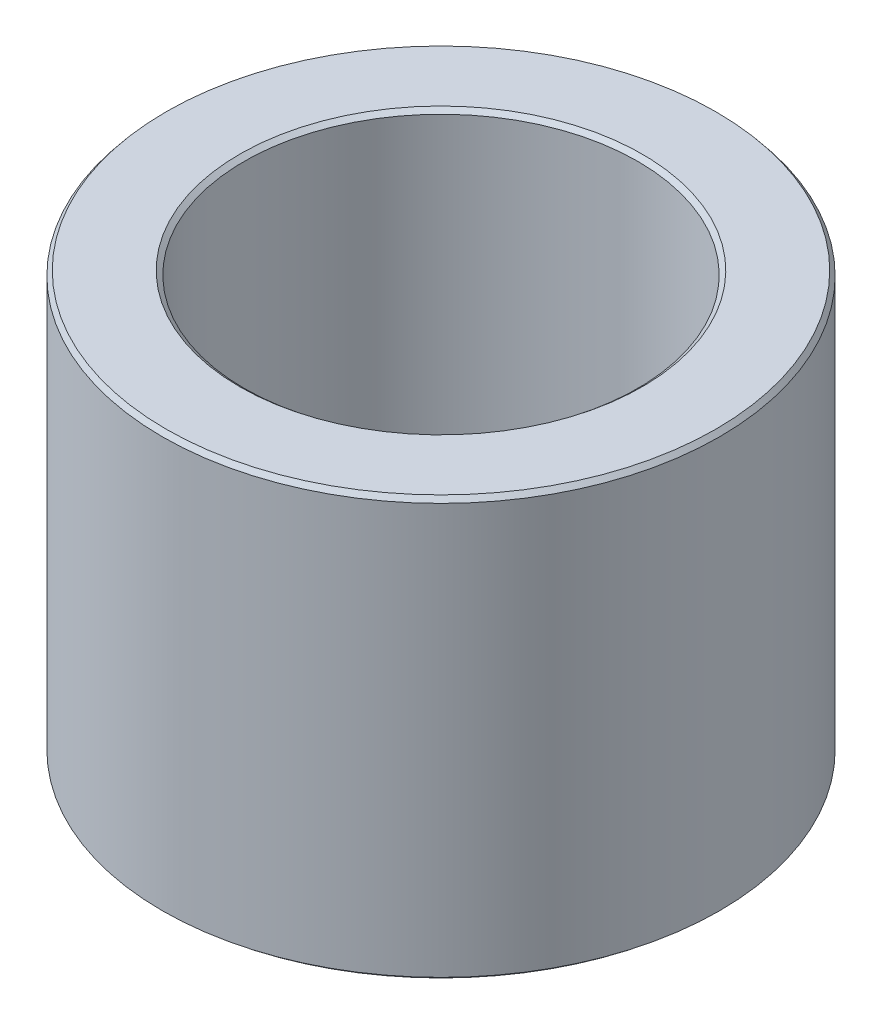
ISO-10303-21;
HEADER;
FILE_DESCRIPTION(('STEP AP214'),'2;1');
FILE_NAME('part.step','',(''),(''),'','','');
FILE_SCHEMA(('AUTOMOTIVE_DESIGN { 1 0 10303 214 1 1 1 1 }'));
ENDSEC;
DATA;
#1=APPLICATION_CONTEXT('core data for automotive mechanical design processes');
#2=APPLICATION_PROTOCOL_DEFINITION('international standard','automotive_design',2000,#1);
#3=PRODUCT_CONTEXT('',#1,'mechanical');
#4=PRODUCT('Part','Part','',(#3));
#5=PRODUCT_RELATED_PRODUCT_CATEGORY('part','',(#4));
#6=PRODUCT_DEFINITION_FORMATION('','',#4);
#7=PRODUCT_DEFINITION_CONTEXT('part definition',#1,'design');
#8=PRODUCT_DEFINITION('design','',#6,#7);
#9=PRODUCT_DEFINITION_SHAPE('','',#8);
#10=(LENGTH_UNIT() NAMED_UNIT(*) SI_UNIT(.MILLI.,.METRE.));
#11=(NAMED_UNIT(*) PLANE_ANGLE_UNIT() SI_UNIT($,.RADIAN.));
#12=(NAMED_UNIT(*) SI_UNIT($,.STERADIAN.) SOLID_ANGLE_UNIT());
#13=UNCERTAINTY_MEASURE_WITH_UNIT(LENGTH_MEASURE(1.E-05),#10,'distance_accuracy_value','');
#14=(GEOMETRIC_REPRESENTATION_CONTEXT(3) GLOBAL_UNCERTAINTY_ASSIGNED_CONTEXT((#13)) GLOBAL_UNIT_ASSIGNED_CONTEXT((#10,
#11,#12)) REPRESENTATION_CONTEXT('',''));
#15=CARTESIAN_POINT('',(0.,0.,0.));
#16=DIRECTION('',(0.,0.,1.));
#17=DIRECTION('',(1.,0.,0.));
#18=AXIS2_PLACEMENT_3D('',#15,#16,#17);
#19=CARTESIAN_POINT('',(0.,82.6806241104287,0.));
#20=DIRECTION('',(0.,-1.,0.));
#21=DIRECTION('',(0.,0.,-1.));
#22=AXIS2_PLACEMENT_3D('',#19,#20,#21);
#23=CYLINDRICAL_SURFACE('',#22,55.);
#24=CARTESIAN_POINT('',(0.,0.753056338464786,0.));
#25=DIRECTION('',(0.,1.,0.));
#26=DIRECTION('',(0.,0.,1.));
#27=AXIS2_PLACEMENT_3D('',#24,#25,#26);
#28=CIRCLE('',#27,55.);
#29=CARTESIAN_POINT('',(0.,0.753056338464786,55.));
#30=VERTEX_POINT('',#29);
#31=EDGE_CURVE('E10',#30,#30,#28,.T.);
#32=ORIENTED_EDGE('',*,*,#31,.T.);
#33=EDGE_LOOP('',(#32));
#34=FACE_BOUND('',#33,.T.);
#35=CARTESIAN_POINT('',(0.,81.7594876947384,0.));
#36=DIRECTION('',(0.,1.,0.));
#37=DIRECTION('',(0.,0.,1.));
#38=AXIS2_PLACEMENT_3D('',#35,#36,#37);
#39=CIRCLE('',#38,55.);
#40=CARTESIAN_POINT('',(0.,81.7594876947384,55.));
#41=VERTEX_POINT('',#40);
#42=EDGE_CURVE('E50',#41,#41,#39,.F.);
#43=ORIENTED_EDGE('',*,*,#42,.T.);
#44=EDGE_LOOP('',(#43));
#45=FACE_BOUND('',#44,.T.);
#46=ADVANCED_FACE('F39',(#34,#45),#23,.T.);
#47=CARTESIAN_POINT('',(0.,82.6806241104287,0.));
#48=DIRECTION('',(0.,1.,0.));
#49=DIRECTION('',(0.,0.,1.));
#50=AXIS2_PLACEMENT_3D('',#47,#48,#49);
#51=PLANE('',#50);
#52=CARTESIAN_POINT('',(0.,82.6806241104287,0.));
#53=DIRECTION('',(0.,1.,0.));
#54=DIRECTION('',(0.,0.,1.));
#55=AXIS2_PLACEMENT_3D('',#52,#53,#54);
#56=CIRCLE('',#55,39.7428480351677);
#57=CARTESIAN_POINT('',(0.,82.6806241104287,39.7428480351677));
#58=VERTEX_POINT('',#57);
#59=EDGE_CURVE('E58',#58,#58,#56,.F.);
#60=ORIENTED_EDGE('',*,*,#59,.T.);
#61=EDGE_LOOP('',(#60));
#62=FACE_BOUND('',#61,.T.);
#63=CARTESIAN_POINT('',(0.,82.6806241104287,0.));
#64=DIRECTION('',(0.,1.,0.));
#65=DIRECTION('',(0.,0.,1.));
#66=AXIS2_PLACEMENT_3D('',#63,#64,#65);
#67=CIRCLE('',#66,54.2469436615352);
#68=CARTESIAN_POINT('',(0.,82.6806241104287,54.2469436615352));
#69=VERTEX_POINT('',#68);
#70=EDGE_CURVE('E61',#69,#69,#67,.T.);
#71=ORIENTED_EDGE('',*,*,#70,.T.);
#72=EDGE_LOOP('',(#71));
#73=FACE_BOUND('',#72,.T.);
#74=ADVANCED_FACE('F88',(#62,#73),#51,.T.);
#75=CARTESIAN_POINT('',(0.,0.,0.));
#76=DIRECTION('',(0.,1.,0.));
#77=DIRECTION('',(0.,0.,1.));
#78=AXIS2_PLACEMENT_3D('',#75,#76,#77);
#79=PLANE('',#78);
#80=CARTESIAN_POINT('',(0.,0.,0.));
#81=DIRECTION('',(0.,1.,0.));
#82=DIRECTION('',(0.,0.,1.));
#83=AXIS2_PLACEMENT_3D('',#80,#81,#82);
#84=CIRCLE('',#83,39.5747679579423);
#85=CARTESIAN_POINT('',(0.,0.,39.5747679579423));
#86=VERTEX_POINT('',#85);
#87=EDGE_CURVE('E51',#86,#86,#84,.T.);
#88=ORIENTED_EDGE('',*,*,#87,.T.);
#89=EDGE_LOOP('',(#88));
#90=FACE_BOUND('',#89,.T.);
#91=CARTESIAN_POINT('',(0.,0.,0.));
#92=DIRECTION('',(0.,1.,0.));
#93=DIRECTION('',(0.,0.,1.));
#94=AXIS2_PLACEMENT_3D('',#91,#92,#93);
#95=CIRCLE('',#94,54.0788635843098);
#96=CARTESIAN_POINT('',(0.,0.,54.0788635843098));
#97=VERTEX_POINT('',#96);
#98=EDGE_CURVE('E54',#97,#97,#95,.F.);
#99=ORIENTED_EDGE('',*,*,#98,.T.);
#100=EDGE_LOOP('',(#99));
#101=FACE_BOUND('',#100,.T.);
#102=ADVANCED_FACE('F83',(#90,#101),#79,.F.);
#103=CARTESIAN_POINT('',(0.,82.6806241104287,0.));
#104=DIRECTION('',(0.,-1.,0.));
#105=DIRECTION('',(0.,0.,-1.));
#106=AXIS2_PLACEMENT_3D('',#103,#104,#105);
#107=CYLINDRICAL_SURFACE('',#106,38.8217116194775);
#108=CARTESIAN_POINT('',(0.,81.9275677719639,0.));
#109=DIRECTION('',(0.,1.,0.));
#110=DIRECTION('',(0.,0.,1.));
#111=AXIS2_PLACEMENT_3D('',#108,#109,#110);
#112=CIRCLE('',#111,38.8217116194775);
#113=CARTESIAN_POINT('',(0.,81.9275677719639,38.8217116194775));
#114=VERTEX_POINT('',#113);
#115=EDGE_CURVE('E67',#114,#114,#112,.T.);
#116=ORIENTED_EDGE('',*,*,#115,.T.);
#117=EDGE_LOOP('',(#116));
#118=FACE_BOUND('',#117,.T.);
#119=CARTESIAN_POINT('',(0.,0.921136415690249,0.));
#120=DIRECTION('',(0.,1.,0.));
#121=DIRECTION('',(0.,0.,1.));
#122=AXIS2_PLACEMENT_3D('',#119,#120,#121);
#123=CIRCLE('',#122,38.8217116194775);
#124=CARTESIAN_POINT('',(0.,0.921136415690249,38.8217116194775));
#125=VERTEX_POINT('',#124);
#126=EDGE_CURVE('E69',#125,#125,#123,.F.);
#127=ORIENTED_EDGE('',*,*,#126,.T.);
#128=EDGE_LOOP('',(#127));
#129=FACE_BOUND('',#128,.T.);
#130=ADVANCED_FACE('F71',(#118,#129),#107,.F.);
#131=CARTESIAN_POINT('',(0.,81.9275677719639,0.));
#132=DIRECTION('',(0.,1.,0.));
#133=DIRECTION('',(0.,0.,1.));
#134=AXIS2_PLACEMENT_3D('',#131,#132,#133);
#135=CONICAL_SURFACE('',#134,38.8217116194775,0.885457591452533);
#136=ORIENTED_EDGE('',*,*,#59,.F.);
#137=EDGE_LOOP('',(#136));
#138=FACE_BOUND('',#137,.T.);
#139=ORIENTED_EDGE('',*,*,#115,.F.);
#140=EDGE_LOOP('',(#139));
#141=FACE_BOUND('',#140,.T.);
#142=ADVANCED_FACE('F77',(#138,#141),#135,.F.);
#143=CARTESIAN_POINT('',(0.,0.,0.));
#144=DIRECTION('',(0.,-1.,0.));
#145=DIRECTION('',(0.,0.,-1.));
#146=AXIS2_PLACEMENT_3D('',#143,#144,#145);
#147=CONICAL_SURFACE('',#146,39.5747679579423,0.685338735342364);
#148=ORIENTED_EDGE('',*,*,#126,.F.);
#149=EDGE_LOOP('',(#148));
#150=FACE_BOUND('',#149,.T.);
#151=ORIENTED_EDGE('',*,*,#87,.F.);
#152=EDGE_LOOP('',(#151));
#153=FACE_BOUND('',#152,.T.);
#154=ADVANCED_FACE('F73',(#150,#153),#147,.F.);
#155=CARTESIAN_POINT('',(0.,0.753056338464786,0.));
#156=DIRECTION('',(0.,1.,0.));
#157=DIRECTION('',(0.,0.,1.));
#158=AXIS2_PLACEMENT_3D('',#155,#156,#157);
#159=CONICAL_SURFACE('',#158,55.,0.885457591452526);
#160=ORIENTED_EDGE('',*,*,#98,.F.);
#161=EDGE_LOOP('',(#160));
#162=FACE_BOUND('',#161,.T.);
#163=ORIENTED_EDGE('',*,*,#31,.F.);
#164=EDGE_LOOP('',(#163));
#165=FACE_BOUND('',#164,.T.);
#166=ADVANCED_FACE('F76',(#162,#165),#159,.T.);
#167=CARTESIAN_POINT('',(0.,82.6806241104287,0.));
#168=DIRECTION('',(0.,-1.,0.));
#169=DIRECTION('',(0.,0.,-1.));
#170=AXIS2_PLACEMENT_3D('',#167,#168,#169);
#171=CONICAL_SURFACE('',#170,54.2469436615352,0.685338735342376);
#172=ORIENTED_EDGE('',*,*,#42,.F.);
#173=EDGE_LOOP('',(#172));
#174=FACE_BOUND('',#173,.T.);
#175=ORIENTED_EDGE('',*,*,#70,.F.);
#176=EDGE_LOOP('',(#175));
#177=FACE_BOUND('',#176,.T.);
#178=ADVANCED_FACE('F45',(#174,#177),#171,.T.);
#179=CLOSED_SHELL('',(#46,#74,#102,#130,#142,#154,#166,#178));
#180=MANIFOLD_SOLID_BREP('B2',#179);
#181=ADVANCED_BREP_SHAPE_REPRESENTATION('',(#18,#180),#14);
#182=SHAPE_DEFINITION_REPRESENTATION(#9,#181);
ENDSEC;
END-ISO-10303-21;
